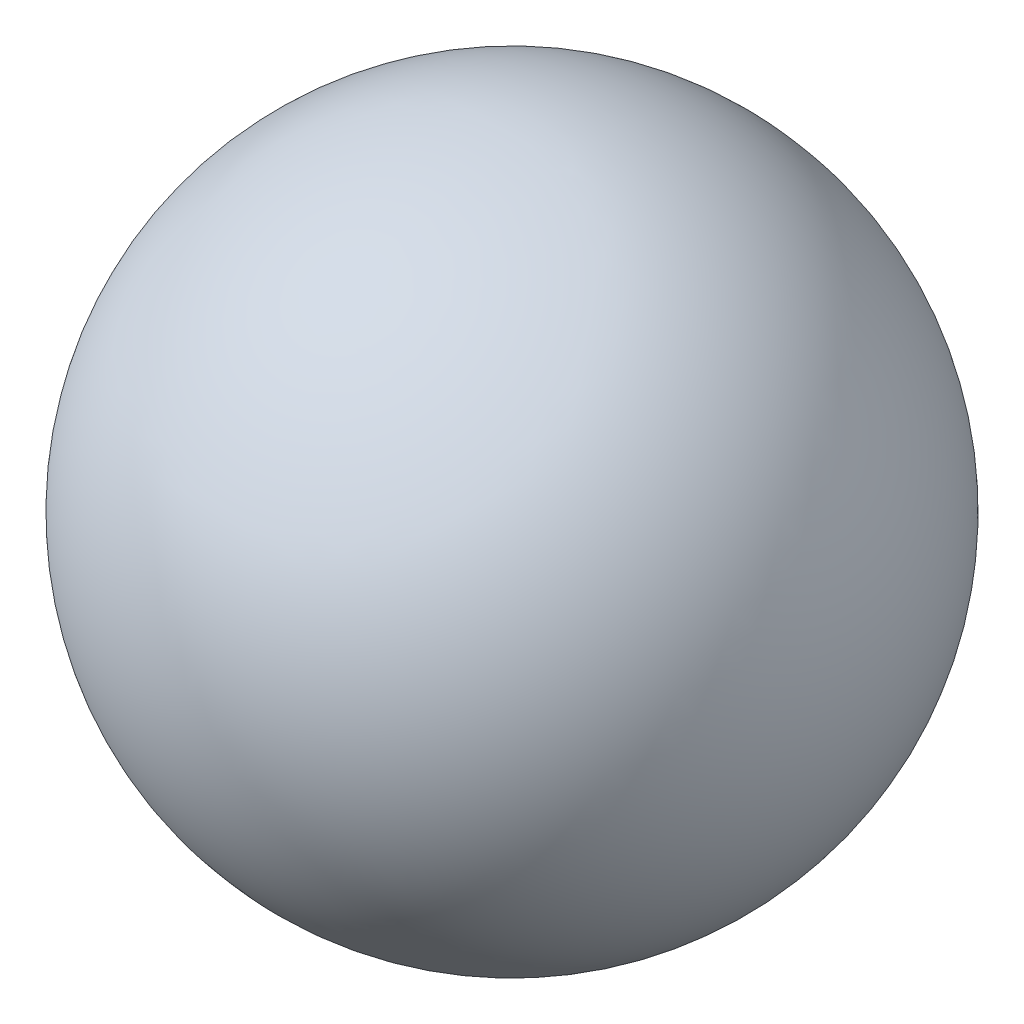
ISO-10303-21;
HEADER;
FILE_DESCRIPTION(('STEP AP214'),'2;1');
FILE_NAME('part.step','',(''),(''),'','','');
FILE_SCHEMA(('AUTOMOTIVE_DESIGN { 1 0 10303 214 1 1 1 1 }'));
ENDSEC;
DATA;
#1=APPLICATION_CONTEXT('core data for automotive mechanical design processes');
#2=APPLICATION_PROTOCOL_DEFINITION('international standard','automotive_design',2000,#1);
#3=PRODUCT_CONTEXT('',#1,'mechanical');
#4=PRODUCT('Part','Part','',(#3));
#5=PRODUCT_RELATED_PRODUCT_CATEGORY('part','',(#4));
#6=PRODUCT_DEFINITION_FORMATION('','',#4);
#7=PRODUCT_DEFINITION_CONTEXT('part definition',#1,'design');
#8=PRODUCT_DEFINITION('design','',#6,#7);
#9=PRODUCT_DEFINITION_SHAPE('','',#8);
#10=(LENGTH_UNIT() NAMED_UNIT(*) SI_UNIT(.MILLI.,.METRE.));
#11=(NAMED_UNIT(*) PLANE_ANGLE_UNIT() SI_UNIT($,.RADIAN.));
#12=(NAMED_UNIT(*) SI_UNIT($,.STERADIAN.) SOLID_ANGLE_UNIT());
#13=UNCERTAINTY_MEASURE_WITH_UNIT(LENGTH_MEASURE(1.E-05),#10,'distance_accuracy_value','');
#14=(GEOMETRIC_REPRESENTATION_CONTEXT(3) GLOBAL_UNCERTAINTY_ASSIGNED_CONTEXT((#13)) GLOBAL_UNIT_ASSIGNED_CONTEXT((#10,
#11,#12)) REPRESENTATION_CONTEXT('',''));
#15=CARTESIAN_POINT('',(0.,0.,0.));
#16=DIRECTION('',(0.,0.,1.));
#17=DIRECTION('',(1.,0.,0.));
#18=AXIS2_PLACEMENT_3D('',#15,#16,#17);
#19=CARTESIAN_POINT('',(64.16,36.5662485822867,-58.9653300984436));
#20=DIRECTION('',(0.,0.527020287134986,-0.84985270308928));
#21=DIRECTION('',(0.173648177666934,0.836941530920705,0.519013664765254));
#22=AXIS2_PLACEMENT_3D('',#19,#20,#21);
#23=SPHERICAL_SURFACE('',#22,7.15);
#24=CARTESIAN_POINT('',(64.16,40.3344436353019,-65.0417769255319));
#25=VERTEX_POINT('',#24);
#26=VERTEX_LOOP('',#25);
#27=FACE_BOUND('',#26,.T.);
#28=CARTESIAN_POINT('',(64.16,32.7980535292715,-52.8888832713552));
#29=VERTEX_POINT('',#28);
#30=VERTEX_LOOP('',#29);
#31=FACE_BOUND('',#30,.T.);
#32=ADVANCED_FACE('F16',(#27,#31),#23,.T.);
#33=CLOSED_SHELL('',(#32));
#34=MANIFOLD_SOLID_BREP('B1',#33);
#35=ADVANCED_BREP_SHAPE_REPRESENTATION('',(#18,#34),#14);
#36=SHAPE_DEFINITION_REPRESENTATION(#9,#35);
ENDSEC;
END-ISO-10303-21;
